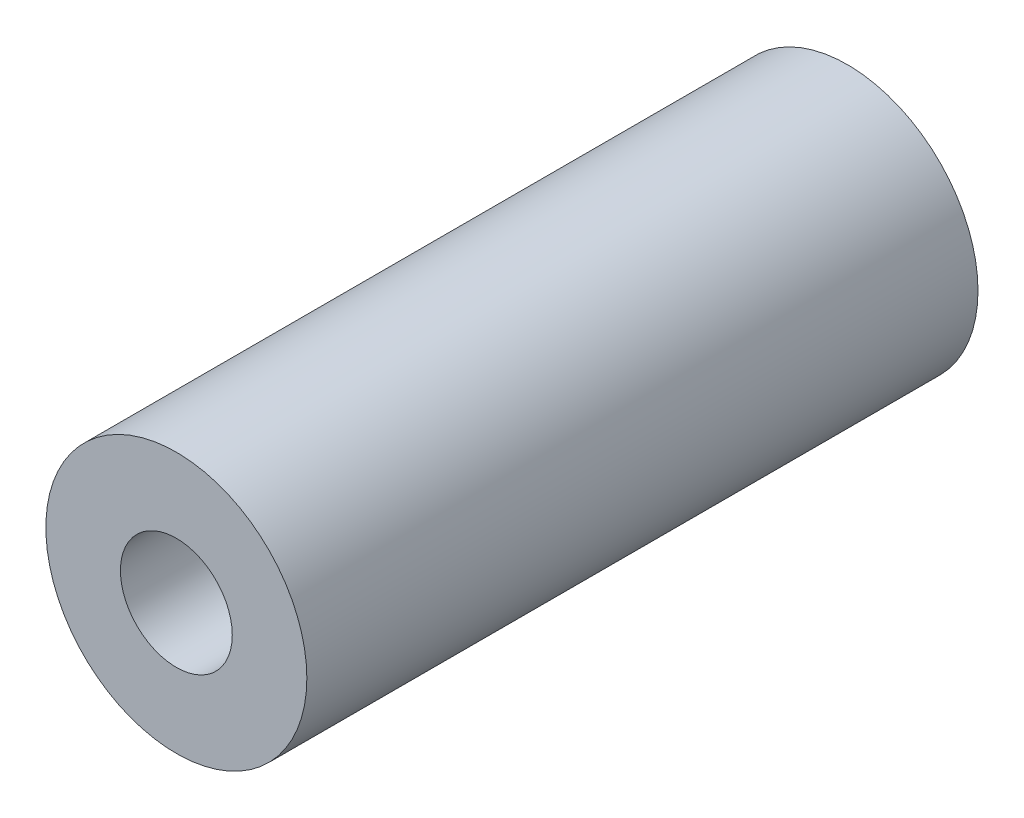
ISO-10303-21;
HEADER;
FILE_DESCRIPTION(('STEP AP214'),'2;1');
FILE_NAME('part.step','',(''),(''),'','','');
FILE_SCHEMA(('AUTOMOTIVE_DESIGN { 1 0 10303 214 1 1 1 1 }'));
ENDSEC;
DATA;
#1=APPLICATION_CONTEXT('core data for automotive mechanical design processes');
#2=APPLICATION_PROTOCOL_DEFINITION('international standard','automotive_design',2000,#1);
#3=PRODUCT_CONTEXT('',#1,'mechanical');
#4=PRODUCT('Part','Part','',(#3));
#5=PRODUCT_RELATED_PRODUCT_CATEGORY('part','',(#4));
#6=PRODUCT_DEFINITION_FORMATION('','',#4);
#7=PRODUCT_DEFINITION_CONTEXT('part definition',#1,'design');
#8=PRODUCT_DEFINITION('design','',#6,#7);
#9=PRODUCT_DEFINITION_SHAPE('','',#8);
#10=(LENGTH_UNIT() NAMED_UNIT(*) SI_UNIT(.MILLI.,.METRE.));
#11=(NAMED_UNIT(*) PLANE_ANGLE_UNIT() SI_UNIT($,.RADIAN.));
#12=(NAMED_UNIT(*) SI_UNIT($,.STERADIAN.) SOLID_ANGLE_UNIT());
#13=UNCERTAINTY_MEASURE_WITH_UNIT(LENGTH_MEASURE(1.E-05),#10,'distance_accuracy_value','');
#14=(GEOMETRIC_REPRESENTATION_CONTEXT(3) GLOBAL_UNCERTAINTY_ASSIGNED_CONTEXT((#13)) GLOBAL_UNIT_ASSIGNED_CONTEXT((#10,
#11,#12)) REPRESENTATION_CONTEXT('',''));
#15=CARTESIAN_POINT('',(0.,0.,0.));
#16=DIRECTION('',(0.,0.,1.));
#17=DIRECTION('',(1.,0.,0.));
#18=AXIS2_PLACEMENT_3D('',#15,#16,#17);
#19=CARTESIAN_POINT('',(0.,0.,57.15));
#20=DIRECTION('',(0.,0.,1.));
#21=DIRECTION('',(1.,0.,0.));
#22=AXIS2_PLACEMENT_3D('',#19,#20,#21);
#23=PLANE('',#22);
#24=CARTESIAN_POINT('',(0.,0.,57.15));
#25=DIRECTION('',(0.,0.,1.));
#26=DIRECTION('',(1.,0.,0.));
#27=AXIS2_PLACEMENT_3D('',#24,#25,#26);
#28=CIRCLE('',#27,11.1125);
#29=CARTESIAN_POINT('',(11.1125,0.,57.15));
#30=VERTEX_POINT('',#29);
#31=EDGE_CURVE('E10',#30,#30,#28,.T.);
#32=ORIENTED_EDGE('',*,*,#31,.T.);
#33=EDGE_LOOP('',(#32));
#34=FACE_BOUND('',#33,.T.);
#35=CARTESIAN_POINT('',(0.,0.,57.15));
#36=DIRECTION('',(0.,0.,1.));
#37=DIRECTION('',(1.,0.,0.));
#38=AXIS2_PLACEMENT_3D('',#35,#36,#37);
#39=CIRCLE('',#38,4.7625);
#40=CARTESIAN_POINT('',(4.7625,0.,57.15));
#41=VERTEX_POINT('',#40);
#42=EDGE_CURVE('E44',#41,#41,#39,.T.);
#43=ORIENTED_EDGE('',*,*,#42,.F.);
#44=EDGE_LOOP('',(#43));
#45=FACE_BOUND('',#44,.T.);
#46=ADVANCED_FACE('F33',(#34,#45),#23,.T.);
#47=CARTESIAN_POINT('',(0.,0.,0.));
#48=DIRECTION('',(0.,0.,1.));
#49=DIRECTION('',(1.,0.,0.));
#50=AXIS2_PLACEMENT_3D('',#47,#48,#49);
#51=PLANE('',#50);
#52=CARTESIAN_POINT('',(0.,0.,0.));
#53=DIRECTION('',(0.,0.,1.));
#54=DIRECTION('',(1.,0.,0.));
#55=AXIS2_PLACEMENT_3D('',#52,#53,#54);
#56=CIRCLE('',#55,11.1125);
#57=CARTESIAN_POINT('',(11.1125,0.,0.));
#58=VERTEX_POINT('',#57);
#59=EDGE_CURVE('E37',#58,#58,#56,.T.);
#60=ORIENTED_EDGE('',*,*,#59,.F.);
#61=EDGE_LOOP('',(#60));
#62=FACE_BOUND('',#61,.T.);
#63=CARTESIAN_POINT('',(0.,0.,0.));
#64=DIRECTION('',(0.,0.,1.));
#65=DIRECTION('',(1.,0.,0.));
#66=AXIS2_PLACEMENT_3D('',#63,#64,#65);
#67=CIRCLE('',#66,4.7625);
#68=CARTESIAN_POINT('',(4.7625,0.,0.));
#69=VERTEX_POINT('',#68);
#70=EDGE_CURVE('E46',#69,#69,#67,.T.);
#71=ORIENTED_EDGE('',*,*,#70,.T.);
#72=EDGE_LOOP('',(#71));
#73=FACE_BOUND('',#72,.T.);
#74=ADVANCED_FACE('F56',(#62,#73),#51,.F.);
#75=CARTESIAN_POINT('',(0.,0.,57.15));
#76=DIRECTION('',(0.,0.,-1.));
#77=DIRECTION('',(-1.,0.,0.));
#78=AXIS2_PLACEMENT_3D('',#75,#76,#77);
#79=CYLINDRICAL_SURFACE('',#78,11.1125);
#80=ORIENTED_EDGE('',*,*,#31,.F.);
#81=EDGE_LOOP('',(#80));
#82=FACE_BOUND('',#81,.T.);
#83=ORIENTED_EDGE('',*,*,#59,.T.);
#84=EDGE_LOOP('',(#83));
#85=FACE_BOUND('',#84,.T.);
#86=ADVANCED_FACE('F35',(#82,#85),#79,.T.);
#87=CARTESIAN_POINT('',(0.,0.,57.15));
#88=DIRECTION('',(0.,0.,-1.));
#89=DIRECTION('',(-1.,0.,0.));
#90=AXIS2_PLACEMENT_3D('',#87,#88,#89);
#91=CYLINDRICAL_SURFACE('',#90,4.7625);
#92=ORIENTED_EDGE('',*,*,#42,.T.);
#93=EDGE_LOOP('',(#92));
#94=FACE_BOUND('',#93,.T.);
#95=ORIENTED_EDGE('',*,*,#70,.F.);
#96=EDGE_LOOP('',(#95));
#97=FACE_BOUND('',#96,.T.);
#98=ADVANCED_FACE('F52',(#94,#97),#91,.F.);
#99=CLOSED_SHELL('',(#46,#74,#86,#98));
#100=MANIFOLD_SOLID_BREP('B2',#99);
#101=ADVANCED_BREP_SHAPE_REPRESENTATION('',(#18,#100),#14);
#102=SHAPE_DEFINITION_REPRESENTATION(#9,#101);
ENDSEC;
END-ISO-10303-21;
